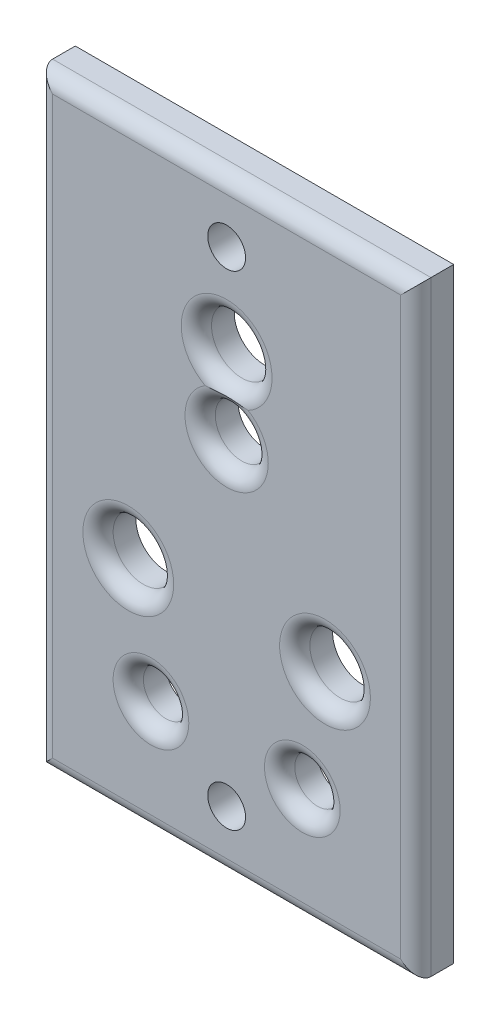
ISO-10303-21;
HEADER;
FILE_DESCRIPTION(('STEP AP214'),'2;1');
FILE_NAME('part.step','',(''),(''),'','','');
FILE_SCHEMA(('AUTOMOTIVE_DESIGN { 1 0 10303 214 1 1 1 1 }'));
ENDSEC;
DATA;
#1=APPLICATION_CONTEXT('core data for automotive mechanical design processes');
#2=APPLICATION_PROTOCOL_DEFINITION('international standard','automotive_design',2000,#1);
#3=PRODUCT_CONTEXT('',#1,'mechanical');
#4=PRODUCT('Part','Part','',(#3));
#5=PRODUCT_RELATED_PRODUCT_CATEGORY('part','',(#4));
#6=PRODUCT_DEFINITION_FORMATION('','',#4);
#7=PRODUCT_DEFINITION_CONTEXT('part definition',#1,'design');
#8=PRODUCT_DEFINITION('design','',#6,#7);
#9=PRODUCT_DEFINITION_SHAPE('','',#8);
#10=(LENGTH_UNIT() NAMED_UNIT(*) SI_UNIT(.MILLI.,.METRE.));
#11=(NAMED_UNIT(*) PLANE_ANGLE_UNIT() SI_UNIT($,.RADIAN.));
#12=(NAMED_UNIT(*) SI_UNIT($,.STERADIAN.) SOLID_ANGLE_UNIT());
#13=UNCERTAINTY_MEASURE_WITH_UNIT(LENGTH_MEASURE(1.E-05),#10,'distance_accuracy_value','');
#14=(GEOMETRIC_REPRESENTATION_CONTEXT(3) GLOBAL_UNCERTAINTY_ASSIGNED_CONTEXT((#13)) GLOBAL_UNIT_ASSIGNED_CONTEXT((#10,
#11,#12)) REPRESENTATION_CONTEXT('',''));
#15=CARTESIAN_POINT('',(0.,0.,0.));
#16=DIRECTION('',(0.,0.,1.));
#17=DIRECTION('',(1.,0.,0.));
#18=AXIS2_PLACEMENT_3D('',#15,#16,#17);
#19=CARTESIAN_POINT('',(-25.,40.,5.));
#20=DIRECTION('',(1.,0.,0.));
#21=DIRECTION('',(0.,1.,0.));
#22=AXIS2_PLACEMENT_3D('',#19,#20,#21);
#23=PLANE('',#22);
#24=DIRECTION('',(0.,0.,-1.));
#25=VECTOR('',#24,1.);
#26=CARTESIAN_POINT('',(-25.,-40.,5.));
#27=LINE('',#26,#25);
#28=CARTESIAN_POINT('',(-25.,-40.,3.));
#29=VERTEX_POINT('',#28);
#30=CARTESIAN_POINT('',(-25.,-40.,0.));
#31=VERTEX_POINT('',#30);
#32=EDGE_CURVE('E108',#29,#31,#27,.T.);
#33=ORIENTED_EDGE('',*,*,#32,.F.);
#34=DIRECTION('',(0.,-1.,0.));
#35=VECTOR('',#34,1.);
#36=CARTESIAN_POINT('',(-25.,40.,3.));
#37=LINE('',#36,#35);
#38=CARTESIAN_POINT('',(-25.,40.,3.));
#39=VERTEX_POINT('',#38);
#40=EDGE_CURVE('E184',#29,#39,#37,.F.);
#41=ORIENTED_EDGE('',*,*,#40,.T.);
#42=DIRECTION('',(0.,0.,-1.));
#43=VECTOR('',#42,1.);
#44=CARTESIAN_POINT('',(-25.,40.,5.));
#45=LINE('',#44,#43);
#46=CARTESIAN_POINT('',(-25.,40.,0.));
#47=VERTEX_POINT('',#46);
#48=EDGE_CURVE('E128',#39,#47,#45,.T.);
#49=ORIENTED_EDGE('',*,*,#48,.T.);
#50=DIRECTION('',(0.,-1.,0.));
#51=VECTOR('',#50,1.);
#52=CARTESIAN_POINT('',(-25.,40.,0.));
#53=LINE('',#52,#51);
#54=EDGE_CURVE('E123',#47,#31,#53,.T.);
#55=ORIENTED_EDGE('',*,*,#54,.T.);
#56=EDGE_LOOP('',(#33,#41,#49,#55));
#57=FACE_BOUND('',#56,.T.);
#58=ADVANCED_FACE('F41',(#57),#23,.F.);
#59=CARTESIAN_POINT('',(-25.,-40.,5.));
#60=DIRECTION('',(0.,1.,0.));
#61=DIRECTION('',(0.,0.,1.));
#62=AXIS2_PLACEMENT_3D('',#59,#60,#61);
#63=PLANE('',#62);
#64=DIRECTION('',(0.,0.,-1.));
#65=VECTOR('',#64,1.);
#66=CARTESIAN_POINT('',(25.,-40.,5.));
#67=LINE('',#66,#65);
#68=CARTESIAN_POINT('',(25.,-40.,3.));
#69=VERTEX_POINT('',#68);
#70=CARTESIAN_POINT('',(25.,-40.,0.));
#71=VERTEX_POINT('',#70);
#72=EDGE_CURVE('E117',#69,#71,#67,.T.);
#73=ORIENTED_EDGE('',*,*,#72,.F.);
#74=DIRECTION('',(1.,0.,0.));
#75=VECTOR('',#74,1.);
#76=CARTESIAN_POINT('',(-25.,-40.,3.));
#77=LINE('',#76,#75);
#78=EDGE_CURVE('E59',#69,#29,#77,.F.);
#79=ORIENTED_EDGE('',*,*,#78,.T.);
#80=ORIENTED_EDGE('',*,*,#32,.T.);
#81=DIRECTION('',(1.,0.,0.));
#82=VECTOR('',#81,1.);
#83=CARTESIAN_POINT('',(-25.,-40.,0.));
#84=LINE('',#83,#82);
#85=EDGE_CURVE('E111',#31,#71,#84,.T.);
#86=ORIENTED_EDGE('',*,*,#85,.T.);
#87=EDGE_LOOP('',(#73,#79,#80,#86));
#88=FACE_BOUND('',#87,.T.);
#89=ADVANCED_FACE('F110',(#88),#63,.F.);
#90=CARTESIAN_POINT('',(25.,40.,5.));
#91=DIRECTION('',(-1.,0.,0.));
#92=DIRECTION('',(0.,-1.,0.));
#93=AXIS2_PLACEMENT_3D('',#90,#91,#92);
#94=PLANE('',#93);
#95=DIRECTION('',(0.,0.,-1.));
#96=VECTOR('',#95,1.);
#97=CARTESIAN_POINT('',(25.,40.,5.));
#98=LINE('',#97,#96);
#99=CARTESIAN_POINT('',(25.,40.,3.));
#100=VERTEX_POINT('',#99);
#101=CARTESIAN_POINT('',(25.,40.,0.));
#102=VERTEX_POINT('',#101);
#103=EDGE_CURVE('E142',#100,#102,#98,.T.);
#104=ORIENTED_EDGE('',*,*,#103,.F.);
#105=DIRECTION('',(0.,1.,0.));
#106=VECTOR('',#105,1.);
#107=CARTESIAN_POINT('',(25.,-40.,3.));
#108=LINE('',#107,#106);
#109=EDGE_CURVE('E67',#100,#69,#108,.F.);
#110=ORIENTED_EDGE('',*,*,#109,.T.);
#111=ORIENTED_EDGE('',*,*,#72,.T.);
#112=DIRECTION('',(0.,1.,0.));
#113=VECTOR('',#112,1.);
#114=CARTESIAN_POINT('',(25.,40.,0.));
#115=LINE('',#114,#113);
#116=EDGE_CURVE('E125',#71,#102,#115,.T.);
#117=ORIENTED_EDGE('',*,*,#116,.T.);
#118=EDGE_LOOP('',(#104,#110,#111,#117));
#119=FACE_BOUND('',#118,.T.);
#120=ADVANCED_FACE('F248',(#119),#94,.F.);
#121=CARTESIAN_POINT('',(-25.,40.,5.));
#122=DIRECTION('',(0.,-1.,0.));
#123=DIRECTION('',(0.,0.,-1.));
#124=AXIS2_PLACEMENT_3D('',#121,#122,#123);
#125=PLANE('',#124);
#126=ORIENTED_EDGE('',*,*,#48,.F.);
#127=DIRECTION('',(-1.,0.,0.));
#128=VECTOR('',#127,1.);
#129=CARTESIAN_POINT('',(25.,40.,3.));
#130=LINE('',#129,#128);
#131=EDGE_CURVE('E178',#39,#100,#130,.F.);
#132=ORIENTED_EDGE('',*,*,#131,.T.);
#133=ORIENTED_EDGE('',*,*,#103,.T.);
#134=DIRECTION('',(-1.,0.,0.));
#135=VECTOR('',#134,1.);
#136=CARTESIAN_POINT('',(-25.,40.,0.));
#137=LINE('',#136,#135);
#138=EDGE_CURVE('E139',#102,#47,#137,.T.);
#139=ORIENTED_EDGE('',*,*,#138,.T.);
#140=EDGE_LOOP('',(#126,#132,#133,#139));
#141=FACE_BOUND('',#140,.T.);
#142=ADVANCED_FACE('F343',(#141),#125,.F.);
#143=CARTESIAN_POINT('',(-25.,-40.,5.));
#144=DIRECTION('',(0.,0.,1.));
#145=DIRECTION('',(1.,0.,0.));
#146=AXIS2_PLACEMENT_3D('',#143,#144,#145);
#147=PLANE('',#146);
#148=CARTESIAN_POINT('',(0.,-32.,5.));
#149=DIRECTION('',(0.,0.,1.));
#150=DIRECTION('',(1.,0.,0.));
#151=AXIS2_PLACEMENT_3D('',#148,#149,#150);
#152=CIRCLE('',#151,2.5);
#153=CARTESIAN_POINT('',(2.50000000000001,-32.,5.));
#154=VERTEX_POINT('',#153);
#155=EDGE_CURVE('E305',#154,#154,#152,.T.);
#156=ORIENTED_EDGE('',*,*,#155,.F.);
#157=EDGE_LOOP('',(#156));
#158=FACE_BOUND('',#157,.T.);
#159=CARTESIAN_POINT('',(0.,32.,5.));
#160=DIRECTION('',(0.,0.,1.));
#161=DIRECTION('',(1.,0.,0.));
#162=AXIS2_PLACEMENT_3D('',#159,#160,#161);
#163=CIRCLE('',#162,2.5);
#164=CARTESIAN_POINT('',(2.5,32.,5.));
#165=VERTEX_POINT('',#164);
#166=EDGE_CURVE('E301',#165,#165,#163,.T.);
#167=ORIENTED_EDGE('',*,*,#166,.F.);
#168=EDGE_LOOP('',(#167));
#169=FACE_BOUND('',#168,.T.);
#170=DIRECTION('',(0.,1.,0.));
#171=VECTOR('',#170,1.);
#172=CARTESIAN_POINT('',(23.,40.,5.));
#173=LINE('',#172,#171);
#174=CARTESIAN_POINT('',(23.,-38.,5.));
#175=VERTEX_POINT('',#174);
#176=CARTESIAN_POINT('',(23.,38.,5.));
#177=VERTEX_POINT('',#176);
#178=EDGE_CURVE('E172',#175,#177,#173,.T.);
#179=ORIENTED_EDGE('',*,*,#178,.T.);
#180=DIRECTION('',(-1.,0.,0.));
#181=VECTOR('',#180,1.);
#182=CARTESIAN_POINT('',(-25.,38.,5.));
#183=LINE('',#182,#181);
#184=CARTESIAN_POINT('',(-23.,38.,5.));
#185=VERTEX_POINT('',#184);
#186=EDGE_CURVE('E175',#177,#185,#183,.T.);
#187=ORIENTED_EDGE('',*,*,#186,.T.);
#188=DIRECTION('',(0.,-1.,0.));
#189=VECTOR('',#188,1.);
#190=CARTESIAN_POINT('',(-23.,-40.,5.));
#191=LINE('',#190,#189);
#192=CARTESIAN_POINT('',(-23.,-38.,5.));
#193=VERTEX_POINT('',#192);
#194=EDGE_CURVE('E168',#185,#193,#191,.T.);
#195=ORIENTED_EDGE('',*,*,#194,.T.);
#196=DIRECTION('',(1.,0.,0.));
#197=VECTOR('',#196,1.);
#198=CARTESIAN_POINT('',(25.,-38.,5.));
#199=LINE('',#198,#197);
#200=EDGE_CURVE('E170',#193,#175,#199,.T.);
#201=ORIENTED_EDGE('',*,*,#200,.T.);
#202=EDGE_LOOP('',(#179,#187,#195,#201));
#203=FACE_BOUND('',#202,.T.);
#204=CARTESIAN_POINT('',(-9.99999999999999,-25.,5.));
#205=DIRECTION('',(0.,0.,1.));
#206=DIRECTION('',(1.,0.,0.));
#207=AXIS2_PLACEMENT_3D('',#204,#205,#206);
#208=CIRCLE('',#207,5.);
#209=CARTESIAN_POINT('',(-4.99999999999999,-25.,5.));
#210=VERTEX_POINT('',#209);
#211=EDGE_CURVE('E165',#210,#210,#208,.F.);
#212=ORIENTED_EDGE('',*,*,#211,.T.);
#213=EDGE_LOOP('',(#212));
#214=FACE_BOUND('',#213,.T.);
#215=CARTESIAN_POINT('',(10.,-25.,5.));
#216=DIRECTION('',(0.,0.,1.));
#217=DIRECTION('',(1.,0.,0.));
#218=AXIS2_PLACEMENT_3D('',#215,#216,#217);
#219=CIRCLE('',#218,5.);
#220=CARTESIAN_POINT('',(15.,-25.,5.));
#221=VERTEX_POINT('',#220);
#222=EDGE_CURVE('E161',#221,#221,#219,.F.);
#223=ORIENTED_EDGE('',*,*,#222,.T.);
#224=EDGE_LOOP('',(#223));
#225=FACE_BOUND('',#224,.T.);
#226=CARTESIAN_POINT('',(13.,-10.1123749084696,5.));
#227=DIRECTION('',(0.,0.,1.));
#228=DIRECTION('',(1.,0.,0.));
#229=AXIS2_PLACEMENT_3D('',#226,#227,#228);
#230=CIRCLE('',#229,6.);
#231=CARTESIAN_POINT('',(19.,-10.1123749084696,5.));
#232=VERTEX_POINT('',#231);
#233=EDGE_CURVE('E157',#232,#232,#230,.F.);
#234=ORIENTED_EDGE('',*,*,#233,.T.);
#235=EDGE_LOOP('',(#234));
#236=FACE_BOUND('',#235,.T.);
#237=CARTESIAN_POINT('',(-13.,-10.1123749084696,5.));
#238=DIRECTION('',(0.,0.,1.));
#239=DIRECTION('',(1.,0.,0.));
#240=AXIS2_PLACEMENT_3D('',#237,#238,#239);
#241=CIRCLE('',#240,6.);
#242=CARTESIAN_POINT('',(-6.99999999999999,-10.1123749084696,5.));
#243=VERTEX_POINT('',#242);
#244=EDGE_CURVE('E154',#243,#243,#241,.F.);
#245=ORIENTED_EDGE('',*,*,#244,.T.);
#246=EDGE_LOOP('',(#245));
#247=FACE_BOUND('',#246,.T.);
#248=CARTESIAN_POINT('',(0.,10.,5.));
#249=DIRECTION('',(0.,0.,1.));
#250=DIRECTION('',(1.,0.,0.));
#251=AXIS2_PLACEMENT_3D('',#248,#249,#250);
#252=CIRCLE('',#251,5.5);
#253=CARTESIAN_POINT('',(5.5,10.,5.));
#254=VERTEX_POINT('',#253);
#255=CARTESIAN_POINT('',(-2.83590263408319,14.7125,5.));
#256=VERTEX_POINT('',#255);
#257=EDGE_CURVE('E116',#254,#256,#252,.F.);
#258=ORIENTED_EDGE('',*,*,#257,.T.);
#259=CARTESIAN_POINT('',(0.,20.,5.));
#260=DIRECTION('',(0.,0.,1.));
#261=DIRECTION('',(1.,0.,0.));
#262=AXIS2_PLACEMENT_3D('',#259,#260,#261);
#263=CIRCLE('',#262,6.);
#264=CARTESIAN_POINT('',(6.,20.,5.));
#265=VERTEX_POINT('',#264);
#266=EDGE_CURVE('E151',#256,#265,#263,.F.);
#267=ORIENTED_EDGE('',*,*,#266,.T.);
#268=CARTESIAN_POINT('',(0.,20.,5.));
#269=DIRECTION('',(0.,0.,1.));
#270=DIRECTION('',(1.,0.,0.));
#271=AXIS2_PLACEMENT_3D('',#268,#269,#270);
#272=CIRCLE('',#271,6.);
#273=CARTESIAN_POINT('',(2.8359026340832,14.7125,5.));
#274=VERTEX_POINT('',#273);
#275=EDGE_CURVE('E149',#265,#274,#272,.F.);
#276=ORIENTED_EDGE('',*,*,#275,.T.);
#277=CARTESIAN_POINT('',(0.,10.,5.));
#278=DIRECTION('',(0.,0.,1.));
#279=DIRECTION('',(1.,0.,0.));
#280=AXIS2_PLACEMENT_3D('',#277,#278,#279);
#281=CIRCLE('',#280,5.5);
#282=EDGE_CURVE('E147',#274,#254,#281,.F.);
#283=ORIENTED_EDGE('',*,*,#282,.T.);
#284=EDGE_LOOP('',(#258,#267,#276,#283));
#285=FACE_BOUND('',#284,.T.);
#286=ADVANCED_FACE('F340',(#158,#169,#203,#214,#225,#236,#247,#285),#147,.T.);
#287=CARTESIAN_POINT('',(-25.,-40.,0.));
#288=DIRECTION('',(0.,0.,1.));
#289=DIRECTION('',(1.,0.,0.));
#290=AXIS2_PLACEMENT_3D('',#287,#288,#289);
#291=PLANE('',#290);
#292=CARTESIAN_POINT('',(0.,-32.,0.));
#293=DIRECTION('',(0.,0.,1.));
#294=DIRECTION('',(1.,0.,0.));
#295=AXIS2_PLACEMENT_3D('',#292,#293,#294);
#296=CIRCLE('',#295,2.5);
#297=CARTESIAN_POINT('',(2.50000000000001,-32.,0.));
#298=VERTEX_POINT('',#297);
#299=EDGE_CURVE('E45',#298,#298,#296,.T.);
#300=ORIENTED_EDGE('',*,*,#299,.T.);
#301=EDGE_LOOP('',(#300));
#302=FACE_BOUND('',#301,.T.);
#303=CARTESIAN_POINT('',(0.,32.,0.));
#304=DIRECTION('',(0.,0.,1.));
#305=DIRECTION('',(1.,0.,0.));
#306=AXIS2_PLACEMENT_3D('',#303,#304,#305);
#307=CIRCLE('',#306,2.5);
#308=CARTESIAN_POINT('',(2.5,32.,0.));
#309=VERTEX_POINT('',#308);
#310=EDGE_CURVE('E221',#309,#309,#307,.T.);
#311=ORIENTED_EDGE('',*,*,#310,.T.);
#312=EDGE_LOOP('',(#311));
#313=FACE_BOUND('',#312,.T.);
#314=CARTESIAN_POINT('',(0.,10.,0.));
#315=DIRECTION('',(0.,0.,1.));
#316=DIRECTION('',(1.,0.,0.));
#317=AXIS2_PLACEMENT_3D('',#314,#315,#316);
#318=CIRCLE('',#317,3.5);
#319=CARTESIAN_POINT('',(3.5,10.,0.));
#320=VERTEX_POINT('',#319);
#321=EDGE_CURVE('E213',#320,#320,#318,.T.);
#322=ORIENTED_EDGE('',*,*,#321,.T.);
#323=EDGE_LOOP('',(#322));
#324=FACE_BOUND('',#323,.T.);
#325=CARTESIAN_POINT('',(-13.,-10.1123749084696,0.));
#326=DIRECTION('',(0.,0.,1.));
#327=DIRECTION('',(1.,0.,0.));
#328=AXIS2_PLACEMENT_3D('',#325,#326,#327);
#329=CIRCLE('',#328,4.);
#330=CARTESIAN_POINT('',(-8.99999999999999,-10.1123749084696,0.));
#331=VERTEX_POINT('',#330);
#332=EDGE_CURVE('E296',#331,#331,#329,.T.);
#333=ORIENTED_EDGE('',*,*,#332,.T.);
#334=EDGE_LOOP('',(#333));
#335=FACE_BOUND('',#334,.T.);
#336=CARTESIAN_POINT('',(13.,-10.1123749084696,0.));
#337=DIRECTION('',(0.,0.,1.));
#338=DIRECTION('',(1.,0.,0.));
#339=AXIS2_PLACEMENT_3D('',#336,#337,#338);
#340=CIRCLE('',#339,4.);
#341=CARTESIAN_POINT('',(17.,-10.1123749084696,0.));
#342=VERTEX_POINT('',#341);
#343=EDGE_CURVE('E291',#342,#342,#340,.T.);
#344=ORIENTED_EDGE('',*,*,#343,.T.);
#345=EDGE_LOOP('',(#344));
#346=FACE_BOUND('',#345,.T.);
#347=CARTESIAN_POINT('',(0.,20.,0.));
#348=DIRECTION('',(0.,0.,1.));
#349=DIRECTION('',(1.,0.,0.));
#350=AXIS2_PLACEMENT_3D('',#347,#348,#349);
#351=CIRCLE('',#350,4.);
#352=CARTESIAN_POINT('',(4.,20.,0.));
#353=VERTEX_POINT('',#352);
#354=EDGE_CURVE('E289',#353,#353,#351,.T.);
#355=ORIENTED_EDGE('',*,*,#354,.T.);
#356=EDGE_LOOP('',(#355));
#357=FACE_BOUND('',#356,.T.);
#358=CARTESIAN_POINT('',(10.,-25.,0.));
#359=DIRECTION('',(0.,0.,1.));
#360=DIRECTION('',(1.,0.,0.));
#361=AXIS2_PLACEMENT_3D('',#358,#359,#360);
#362=CIRCLE('',#361,3.);
#363=CARTESIAN_POINT('',(13.,-25.,0.));
#364=VERTEX_POINT('',#363);
#365=EDGE_CURVE('E133',#364,#364,#362,.T.);
#366=ORIENTED_EDGE('',*,*,#365,.T.);
#367=EDGE_LOOP('',(#366));
#368=FACE_BOUND('',#367,.T.);
#369=CARTESIAN_POINT('',(-9.99999999999999,-25.,0.));
#370=DIRECTION('',(0.,0.,1.));
#371=DIRECTION('',(1.,0.,0.));
#372=AXIS2_PLACEMENT_3D('',#369,#370,#371);
#373=CIRCLE('',#372,3.);
#374=CARTESIAN_POINT('',(-6.99999999999999,-25.,0.));
#375=VERTEX_POINT('',#374);
#376=EDGE_CURVE('E130',#375,#375,#373,.T.);
#377=ORIENTED_EDGE('',*,*,#376,.T.);
#378=EDGE_LOOP('',(#377));
#379=FACE_BOUND('',#378,.T.);
#380=ORIENTED_EDGE('',*,*,#54,.F.);
#381=ORIENTED_EDGE('',*,*,#138,.F.);
#382=ORIENTED_EDGE('',*,*,#116,.F.);
#383=ORIENTED_EDGE('',*,*,#85,.F.);
#384=EDGE_LOOP('',(#380,#381,#382,#383));
#385=FACE_BOUND('',#384,.T.);
#386=ADVANCED_FACE('F121',(#302,#313,#324,#335,#346,#357,#368,#379,#385),#291,.F.);
#387=CARTESIAN_POINT('',(-9.99999999999999,-25.,0.));
#388=DIRECTION('',(0.,0.,1.));
#389=DIRECTION('',(1.,0.,0.));
#390=AXIS2_PLACEMENT_3D('',#387,#388,#389);
#391=CYLINDRICAL_SURFACE('',#390,3.);
#392=CARTESIAN_POINT('',(-9.99999999999999,-25.,3.));
#393=DIRECTION('',(0.,0.,1.));
#394=DIRECTION('',(1.,0.,0.));
#395=AXIS2_PLACEMENT_3D('',#392,#393,#394);
#396=CIRCLE('',#395,3.);
#397=CARTESIAN_POINT('',(-6.99999999999999,-25.,3.));
#398=VERTEX_POINT('',#397);
#399=EDGE_CURVE('E186',#398,#398,#396,.T.);
#400=ORIENTED_EDGE('',*,*,#399,.T.);
#401=EDGE_LOOP('',(#400));
#402=FACE_BOUND('',#401,.T.);
#403=ORIENTED_EDGE('',*,*,#376,.F.);
#404=EDGE_LOOP('',(#403));
#405=FACE_BOUND('',#404,.T.);
#406=ADVANCED_FACE('F284',(#402,#405),#391,.F.);
#407=CARTESIAN_POINT('',(10.,-25.,0.));
#408=DIRECTION('',(0.,0.,1.));
#409=DIRECTION('',(1.,0.,0.));
#410=AXIS2_PLACEMENT_3D('',#407,#408,#409);
#411=CYLINDRICAL_SURFACE('',#410,3.);
#412=CARTESIAN_POINT('',(10.,-25.,3.));
#413=DIRECTION('',(0.,0.,1.));
#414=DIRECTION('',(1.,0.,0.));
#415=AXIS2_PLACEMENT_3D('',#412,#413,#414);
#416=CIRCLE('',#415,3.);
#417=CARTESIAN_POINT('',(13.,-25.,3.));
#418=VERTEX_POINT('',#417);
#419=EDGE_CURVE('E189',#418,#418,#416,.T.);
#420=ORIENTED_EDGE('',*,*,#419,.T.);
#421=EDGE_LOOP('',(#420));
#422=FACE_BOUND('',#421,.T.);
#423=ORIENTED_EDGE('',*,*,#365,.F.);
#424=EDGE_LOOP('',(#423));
#425=FACE_BOUND('',#424,.T.);
#426=ADVANCED_FACE('F280',(#422,#425),#411,.F.);
#427=CARTESIAN_POINT('',(0.,20.,0.));
#428=DIRECTION('',(0.,0.,1.));
#429=DIRECTION('',(1.,0.,0.));
#430=AXIS2_PLACEMENT_3D('',#427,#428,#429);
#431=CYLINDRICAL_SURFACE('',#430,4.);
#432=CARTESIAN_POINT('',(0.,20.,3.));
#433=DIRECTION('',(0.,0.,1.));
#434=DIRECTION('',(1.,0.,0.));
#435=AXIS2_PLACEMENT_3D('',#432,#433,#434);
#436=CIRCLE('',#435,4.);
#437=CARTESIAN_POINT('',(4.,20.,3.));
#438=VERTEX_POINT('',#437);
#439=EDGE_CURVE('E192',#438,#438,#436,.T.);
#440=ORIENTED_EDGE('',*,*,#439,.T.);
#441=EDGE_LOOP('',(#440));
#442=FACE_BOUND('',#441,.T.);
#443=ORIENTED_EDGE('',*,*,#354,.F.);
#444=EDGE_LOOP('',(#443));
#445=FACE_BOUND('',#444,.T.);
#446=ADVANCED_FACE('F283',(#442,#445),#431,.F.);
#447=CARTESIAN_POINT('',(13.,-10.1123749084696,0.));
#448=DIRECTION('',(0.,0.,1.));
#449=DIRECTION('',(1.,0.,0.));
#450=AXIS2_PLACEMENT_3D('',#447,#448,#449);
#451=CYLINDRICAL_SURFACE('',#450,4.);
#452=CARTESIAN_POINT('',(13.,-10.1123749084696,3.));
#453=DIRECTION('',(0.,0.,1.));
#454=DIRECTION('',(1.,0.,0.));
#455=AXIS2_PLACEMENT_3D('',#452,#453,#454);
#456=CIRCLE('',#455,4.);
#457=CARTESIAN_POINT('',(17.,-10.1123749084696,3.));
#458=VERTEX_POINT('',#457);
#459=EDGE_CURVE('E196',#458,#458,#456,.T.);
#460=ORIENTED_EDGE('',*,*,#459,.T.);
#461=EDGE_LOOP('',(#460));
#462=FACE_BOUND('',#461,.T.);
#463=ORIENTED_EDGE('',*,*,#343,.F.);
#464=EDGE_LOOP('',(#463));
#465=FACE_BOUND('',#464,.T.);
#466=ADVANCED_FACE('F329',(#462,#465),#451,.F.);
#467=CARTESIAN_POINT('',(-13.,-10.1123749084696,0.));
#468=DIRECTION('',(0.,0.,1.));
#469=DIRECTION('',(1.,0.,0.));
#470=AXIS2_PLACEMENT_3D('',#467,#468,#469);
#471=CYLINDRICAL_SURFACE('',#470,4.);
#472=CARTESIAN_POINT('',(-13.,-10.1123749084696,3.));
#473=DIRECTION('',(0.,0.,1.));
#474=DIRECTION('',(1.,0.,0.));
#475=AXIS2_PLACEMENT_3D('',#472,#473,#474);
#476=CIRCLE('',#475,4.);
#477=CARTESIAN_POINT('',(-8.99999999999999,-10.1123749084696,3.));
#478=VERTEX_POINT('',#477);
#479=EDGE_CURVE('E51',#478,#478,#476,.T.);
#480=ORIENTED_EDGE('',*,*,#479,.T.);
#481=EDGE_LOOP('',(#480));
#482=FACE_BOUND('',#481,.T.);
#483=ORIENTED_EDGE('',*,*,#332,.F.);
#484=EDGE_LOOP('',(#483));
#485=FACE_BOUND('',#484,.T.);
#486=ADVANCED_FACE('F325',(#482,#485),#471,.F.);
#487=CARTESIAN_POINT('',(0.,10.,0.));
#488=DIRECTION('',(0.,0.,1.));
#489=DIRECTION('',(1.,0.,0.));
#490=AXIS2_PLACEMENT_3D('',#487,#488,#489);
#491=CYLINDRICAL_SURFACE('',#490,3.5);
#492=CARTESIAN_POINT('',(0.,10.,3.));
#493=DIRECTION('',(0.,0.,1.));
#494=DIRECTION('',(1.,0.,0.));
#495=AXIS2_PLACEMENT_3D('',#492,#493,#494);
#496=CIRCLE('',#495,3.5);
#497=CARTESIAN_POINT('',(3.5,10.,3.));
#498=VERTEX_POINT('',#497);
#499=EDGE_CURVE('E11',#498,#498,#496,.T.);
#500=ORIENTED_EDGE('',*,*,#499,.T.);
#501=EDGE_LOOP('',(#500));
#502=FACE_BOUND('',#501,.T.);
#503=ORIENTED_EDGE('',*,*,#321,.F.);
#504=EDGE_LOOP('',(#503));
#505=FACE_BOUND('',#504,.T.);
#506=ADVANCED_FACE('F268',(#502,#505),#491,.F.);
#507=CARTESIAN_POINT('',(-25.,-38.,3.));
#508=DIRECTION('',(-1.,0.,0.));
#509=DIRECTION('',(0.,0.,1.));
#510=AXIS2_PLACEMENT_3D('',#507,#508,#509);
#511=CYLINDRICAL_SURFACE('',#510,2.);
#512=CARTESIAN_POINT('',(-23.,-38.,3.));
#513=DIRECTION('',(-0.707106781186548,0.707106781186547,0.));
#514=DIRECTION('',(0.707106781186547,0.707106781186548,0.));
#515=AXIS2_PLACEMENT_3D('',#512,#513,#514);
#516=ELLIPSE('',#515,2.82842712474619,2.);
#517=EDGE_CURVE('E207',#29,#193,#516,.T.);
#518=ORIENTED_EDGE('',*,*,#517,.F.);
#519=ORIENTED_EDGE('',*,*,#78,.F.);
#520=CARTESIAN_POINT('',(23.,-38.,3.));
#521=DIRECTION('',(-0.707106781186547,-0.707106781186548,0.));
#522=DIRECTION('',(-0.707106781186548,0.707106781186547,0.));
#523=AXIS2_PLACEMENT_3D('',#520,#521,#522);
#524=ELLIPSE('',#523,2.82842712474619,2.);
#525=EDGE_CURVE('E210',#175,#69,#524,.F.);
#526=ORIENTED_EDGE('',*,*,#525,.F.);
#527=ORIENTED_EDGE('',*,*,#200,.F.);
#528=EDGE_LOOP('',(#518,#519,#526,#527));
#529=FACE_BOUND('',#528,.T.);
#530=ADVANCED_FACE('F264',(#529),#511,.T.);
#531=CARTESIAN_POINT('',(23.,-40.,3.));
#532=DIRECTION('',(0.,-1.,0.));
#533=DIRECTION('',(1.,0.,0.));
#534=AXIS2_PLACEMENT_3D('',#531,#532,#533);
#535=CYLINDRICAL_SURFACE('',#534,2.);
#536=ORIENTED_EDGE('',*,*,#525,.T.);
#537=ORIENTED_EDGE('',*,*,#109,.F.);
#538=CARTESIAN_POINT('',(23.,38.,3.));
#539=DIRECTION('',(0.707106781186548,-0.707106781186547,0.));
#540=DIRECTION('',(-0.707106781186547,-0.707106781186548,0.));
#541=AXIS2_PLACEMENT_3D('',#538,#539,#540);
#542=ELLIPSE('',#541,2.82842712474619,2.);
#543=EDGE_CURVE('E204',#177,#100,#542,.F.);
#544=ORIENTED_EDGE('',*,*,#543,.F.);
#545=ORIENTED_EDGE('',*,*,#178,.F.);
#546=EDGE_LOOP('',(#536,#537,#544,#545));
#547=FACE_BOUND('',#546,.T.);
#548=ADVANCED_FACE('F260',(#547),#535,.T.);
#549=CARTESIAN_POINT('',(-23.,-40.,3.));
#550=DIRECTION('',(0.,1.,0.));
#551=DIRECTION('',(-1.,0.,0.));
#552=AXIS2_PLACEMENT_3D('',#549,#550,#551);
#553=CYLINDRICAL_SURFACE('',#552,2.);
#554=ORIENTED_EDGE('',*,*,#517,.T.);
#555=ORIENTED_EDGE('',*,*,#194,.F.);
#556=CARTESIAN_POINT('',(-23.,38.,3.));
#557=DIRECTION('',(0.707106781186547,0.707106781186548,0.));
#558=DIRECTION('',(-0.707106781186548,0.707106781186547,0.));
#559=AXIS2_PLACEMENT_3D('',#556,#557,#558);
#560=ELLIPSE('',#559,2.82842712474619,2.);
#561=EDGE_CURVE('E202',#39,#185,#560,.T.);
#562=ORIENTED_EDGE('',*,*,#561,.F.);
#563=ORIENTED_EDGE('',*,*,#40,.F.);
#564=EDGE_LOOP('',(#554,#555,#562,#563));
#565=FACE_BOUND('',#564,.T.);
#566=ADVANCED_FACE('F256',(#565),#553,.T.);
#567=CARTESIAN_POINT('',(-25.,38.,3.));
#568=DIRECTION('',(1.,0.,0.));
#569=DIRECTION('',(0.,0.,-1.));
#570=AXIS2_PLACEMENT_3D('',#567,#568,#569);
#571=CYLINDRICAL_SURFACE('',#570,2.);
#572=ORIENTED_EDGE('',*,*,#543,.T.);
#573=ORIENTED_EDGE('',*,*,#131,.F.);
#574=ORIENTED_EDGE('',*,*,#561,.T.);
#575=ORIENTED_EDGE('',*,*,#186,.F.);
#576=EDGE_LOOP('',(#572,#573,#574,#575));
#577=FACE_BOUND('',#576,.T.);
#578=ADVANCED_FACE('F252',(#577),#571,.T.);
#579=CARTESIAN_POINT('',(-9.99999999999999,-25.,3.));
#580=DIRECTION('',(0.,0.,1.));
#581=DIRECTION('',(1.,0.,0.));
#582=AXIS2_PLACEMENT_3D('',#579,#580,#581);
#583=TOROIDAL_SURFACE('',#582,5.,2.);
#584=ORIENTED_EDGE('',*,*,#211,.F.);
#585=EDGE_LOOP('',(#584));
#586=FACE_BOUND('',#585,.T.);
#587=ORIENTED_EDGE('',*,*,#399,.F.);
#588=EDGE_LOOP('',(#587));
#589=FACE_BOUND('',#588,.T.);
#590=ADVANCED_FACE('F255',(#586,#589),#583,.T.);
#591=CARTESIAN_POINT('',(10.,-25.,3.));
#592=DIRECTION('',(0.,0.,1.));
#593=DIRECTION('',(1.,0.,0.));
#594=AXIS2_PLACEMENT_3D('',#591,#592,#593);
#595=TOROIDAL_SURFACE('',#594,5.,2.);
#596=ORIENTED_EDGE('',*,*,#222,.F.);
#597=EDGE_LOOP('',(#596));
#598=FACE_BOUND('',#597,.T.);
#599=ORIENTED_EDGE('',*,*,#419,.F.);
#600=EDGE_LOOP('',(#599));
#601=FACE_BOUND('',#600,.T.);
#602=ADVANCED_FACE('F229',(#598,#601),#595,.T.);
#603=CARTESIAN_POINT('',(0.,10.,3.));
#604=DIRECTION('',(0.,0.,1.));
#605=DIRECTION('',(1.,0.,0.));
#606=AXIS2_PLACEMENT_3D('',#603,#604,#605);
#607=TOROIDAL_SURFACE('',#606,5.5,2.);
#608=ORIENTED_EDGE('',*,*,#499,.F.);
#609=EDGE_LOOP('',(#608));
#610=FACE_BOUND('',#609,.T.);
#611=CARTESIAN_POINT('',(-2.83590263408319,14.7125,5.));
#612=CARTESIAN_POINT('',(-2.83268745753129,14.7125794852793,4.9999999917108));
#613=CARTESIAN_POINT('',(-2.82947229644201,14.7126588677241,4.9999980965396));
#614=CARTESIAN_POINT('',(-2.49280490082956,14.7209604444258,4.99960354322475));
#615=CARTESIAN_POINT('',(-2.15952332929183,14.728073891562,4.97906842900861));
#616=CARTESIAN_POINT('',(-1.66032326555719,14.7366609052704,4.94163175163199));
#617=CARTESIAN_POINT('',(-1.49393824582876,14.7391769845754,4.92803645128731));
#618=CARTESIAN_POINT('',(-1.16104813506412,14.7434580109552,4.90227462250856));
#619=CARTESIAN_POINT('',(-0.994543092767472,14.7452231753902,4.89010768136022));
#620=CARTESIAN_POINT('',(-0.661188082036639,14.7479526024685,4.87032118910938));
#621=CARTESIAN_POINT('',(-0.494338019886754,14.7489166073306,4.86270310186863));
#622=CARTESIAN_POINT('',(-0.160461882590843,14.7500099511877,4.85400855990672));
#623=CARTESIAN_POINT('',(0.00656417459069921,14.7501393684113,4.8529314920751));
#624=CARTESIAN_POINT('',(0.340493761385323,14.7495588449392,4.85760361351105));
#625=CARTESIAN_POINT('',(0.507397301167798,14.7488489843207,4.86335215153378));
#626=CARTESIAN_POINT('',(0.840934327638144,14.7466152028714,4.88016482126499));
#627=CARTESIAN_POINT('',(1.00756776452263,14.7450911459881,4.89122984132854));
#628=CARTESIAN_POINT('',(1.31170215963427,14.7416065415347,4.91368963142406));
#629=CARTESIAN_POINT('',(1.44923602671503,14.739767788724,4.92469330397032));
#630=CARTESIAN_POINT('',(1.72432584277037,14.7355972506095,4.94639764370464));
#631=CARTESIAN_POINT('',(1.86188179208201,14.7332654568848,4.95709830571384));
#632=CARTESIAN_POINT('',(2.13714581851315,14.7281430871229,4.97606418389225));
#633=CARTESIAN_POINT('',(2.27485387619606,14.725352564183,4.98432968162012));
#634=CARTESIAN_POINT('',(2.55046282556699,14.7193501365159,4.99621317571077));
#635=CARTESIAN_POINT('',(2.68836365489597,14.7161383461685,4.99983243072411));
#636=CARTESIAN_POINT('',(2.82947231667845,14.7126588670873,4.99999810345134));
#637=CARTESIAN_POINT('',(2.83268747814963,14.7125794846148,4.99999999871893));
#638=CARTESIAN_POINT('',(2.8359026340832,14.7125,5.));
#639=B_SPLINE_CURVE_WITH_KNOTS('',3,(#611,#612,#613,#614,#615,#616,#617,#618,#619,#620,#621,
#622,#623,#624,#625,#626,#627,#628,#629,#630,#631,#632,#633,#634,#635,#636,#637,#638),
.UNSPECIFIED.,.F.,.F.,(4,2,2,2,2,2,2,2,2,2,2,2,2,4),(0.,0.00964842400878074,1.01031510520356,
1.51128481778328,2.01210942057836,2.51309510645756,3.01403383263656,3.51492476708034,
4.01589942678359,4.42985844176827,4.84382452760522,5.25774273103982,5.67154878183512,
5.68119720584487),.UNSPECIFIED.);
#640=EDGE_CURVE('E205',#256,#274,#639,.T.);
#641=ORIENTED_EDGE('',*,*,#640,.F.);
#642=ORIENTED_EDGE('',*,*,#257,.F.);
#643=ORIENTED_EDGE('',*,*,#282,.F.);
#644=EDGE_LOOP('',(#641,#642,#643));
#645=FACE_BOUND('',#644,.T.);
#646=ADVANCED_FACE('F224',(#610,#645),#607,.T.);
#647=CARTESIAN_POINT('',(0.,20.,3.));
#648=DIRECTION('',(0.,0.,1.));
#649=DIRECTION('',(1.,0.,0.));
#650=AXIS2_PLACEMENT_3D('',#647,#648,#649);
#651=TOROIDAL_SURFACE('',#650,6.,2.);
#652=ORIENTED_EDGE('',*,*,#266,.F.);
#653=ORIENTED_EDGE('',*,*,#640,.T.);
#654=ORIENTED_EDGE('',*,*,#275,.F.);
#655=EDGE_LOOP('',(#652,#653,#654));
#656=FACE_BOUND('',#655,.T.);
#657=ORIENTED_EDGE('',*,*,#439,.F.);
#658=EDGE_LOOP('',(#657));
#659=FACE_BOUND('',#658,.T.);
#660=ADVANCED_FACE('F228',(#656,#659),#651,.T.);
#661=CARTESIAN_POINT('',(13.,-10.1123749084696,3.));
#662=DIRECTION('',(0.,0.,1.));
#663=DIRECTION('',(1.,0.,0.));
#664=AXIS2_PLACEMENT_3D('',#661,#662,#663);
#665=TOROIDAL_SURFACE('',#664,6.,2.);
#666=ORIENTED_EDGE('',*,*,#233,.F.);
#667=EDGE_LOOP('',(#666));
#668=FACE_BOUND('',#667,.T.);
#669=ORIENTED_EDGE('',*,*,#459,.F.);
#670=EDGE_LOOP('',(#669));
#671=FACE_BOUND('',#670,.T.);
#672=ADVANCED_FACE('F232',(#668,#671),#665,.T.);
#673=CARTESIAN_POINT('',(-13.,-10.1123749084696,3.));
#674=DIRECTION('',(0.,0.,1.));
#675=DIRECTION('',(1.,0.,0.));
#676=AXIS2_PLACEMENT_3D('',#673,#674,#675);
#677=TOROIDAL_SURFACE('',#676,6.,2.);
#678=ORIENTED_EDGE('',*,*,#244,.F.);
#679=EDGE_LOOP('',(#678));
#680=FACE_BOUND('',#679,.T.);
#681=ORIENTED_EDGE('',*,*,#479,.F.);
#682=EDGE_LOOP('',(#681));
#683=FACE_BOUND('',#682,.T.);
#684=ADVANCED_FACE('F43',(#680,#683),#677,.T.);
#685=CARTESIAN_POINT('',(0.,32.,-5.));
#686=DIRECTION('',(0.,0.,1.));
#687=DIRECTION('',(1.,0.,0.));
#688=AXIS2_PLACEMENT_3D('',#685,#686,#687);
#689=CYLINDRICAL_SURFACE('',#688,2.5);
#690=ORIENTED_EDGE('',*,*,#166,.T.);
#691=EDGE_LOOP('',(#690));
#692=FACE_BOUND('',#691,.T.);
#693=ORIENTED_EDGE('',*,*,#310,.F.);
#694=EDGE_LOOP('',(#693));
#695=FACE_BOUND('',#694,.T.);
#696=ADVANCED_FACE('F239',(#692,#695),#689,.F.);
#697=CARTESIAN_POINT('',(0.,-32.,-5.));
#698=DIRECTION('',(0.,0.,1.));
#699=DIRECTION('',(1.,0.,0.));
#700=AXIS2_PLACEMENT_3D('',#697,#698,#699);
#701=CYLINDRICAL_SURFACE('',#700,2.5);
#702=ORIENTED_EDGE('',*,*,#155,.T.);
#703=EDGE_LOOP('',(#702));
#704=FACE_BOUND('',#703,.T.);
#705=ORIENTED_EDGE('',*,*,#299,.F.);
#706=EDGE_LOOP('',(#705));
#707=FACE_BOUND('',#706,.T.);
#708=ADVANCED_FACE('F314',(#704,#707),#701,.F.);
#709=CLOSED_SHELL('',(#58,#89,#120,#142,#286,#386,#406,#426,#446,#466,#486,#506,#530,#548,#566,
#578,#590,#602,#646,#660,#672,#684,#696,#708));
#710=MANIFOLD_SOLID_BREP('B2',#709);
#711=ADVANCED_BREP_SHAPE_REPRESENTATION('',(#18,#710),#14);
#712=SHAPE_DEFINITION_REPRESENTATION(#9,#711);
ENDSEC;
END-ISO-10303-21;
